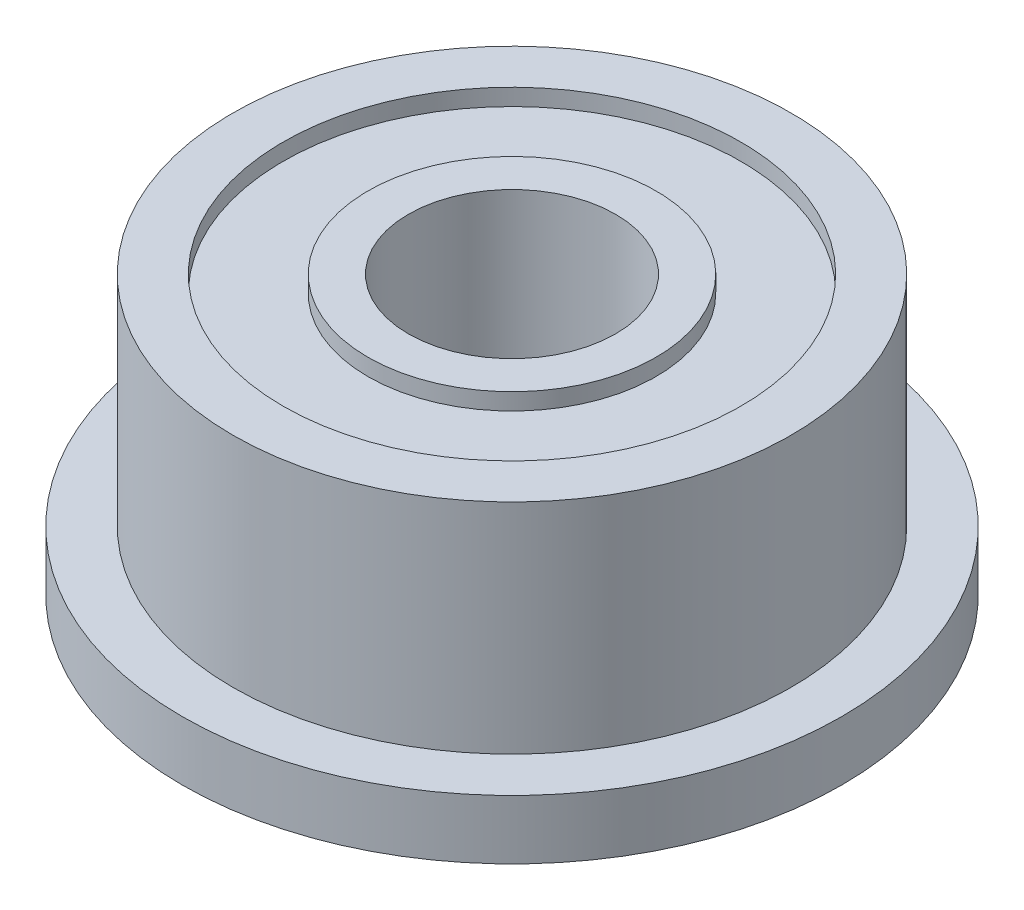
ISO-10303-21;
HEADER;
FILE_DESCRIPTION(('STEP AP214'),'2;1');
FILE_NAME('part.step','',(''),(''),'','','');
FILE_SCHEMA(('AUTOMOTIVE_DESIGN { 1 0 10303 214 1 1 1 1 }'));
ENDSEC;
DATA;
#1=APPLICATION_CONTEXT('core data for automotive mechanical design processes');
#2=APPLICATION_PROTOCOL_DEFINITION('international standard','automotive_design',2000,#1);
#3=PRODUCT_CONTEXT('',#1,'mechanical');
#4=PRODUCT('Part','Part','',(#3));
#5=PRODUCT_RELATED_PRODUCT_CATEGORY('part','',(#4));
#6=PRODUCT_DEFINITION_FORMATION('','',#4);
#7=PRODUCT_DEFINITION_CONTEXT('part definition',#1,'design');
#8=PRODUCT_DEFINITION('design','',#6,#7);
#9=PRODUCT_DEFINITION_SHAPE('','',#8);
#10=(LENGTH_UNIT() NAMED_UNIT(*) SI_UNIT(.MILLI.,.METRE.));
#11=(NAMED_UNIT(*) PLANE_ANGLE_UNIT() SI_UNIT($,.RADIAN.));
#12=(NAMED_UNIT(*) SI_UNIT($,.STERADIAN.) SOLID_ANGLE_UNIT());
#13=UNCERTAINTY_MEASURE_WITH_UNIT(LENGTH_MEASURE(1.E-05),#10,'distance_accuracy_value','');
#14=(GEOMETRIC_REPRESENTATION_CONTEXT(3) GLOBAL_UNCERTAINTY_ASSIGNED_CONTEXT((#13)) GLOBAL_UNIT_ASSIGNED_CONTEXT((#10,
#11,#12)) REPRESENTATION_CONTEXT('',''));
#15=CARTESIAN_POINT('',(0.,0.,0.));
#16=DIRECTION('',(0.,0.,1.));
#17=DIRECTION('',(1.,0.,0.));
#18=AXIS2_PLACEMENT_3D('',#15,#16,#17);
#19=CARTESIAN_POINT('',(0.,0.,0.));
#20=DIRECTION('',(0.,1.,0.));
#21=DIRECTION('',(0.,0.,1.));
#22=AXIS2_PLACEMENT_3D('',#19,#20,#21);
#23=PLANE('',#22);
#24=CARTESIAN_POINT('',(0.,0.,0.));
#25=DIRECTION('',(0.,1.,0.));
#26=DIRECTION('',(0.,0.,1.));
#27=AXIS2_PLACEMENT_3D('',#24,#25,#26);
#28=CIRCLE('',#27,1.485);
#29=CARTESIAN_POINT('',(0.,0.,1.485));
#30=VERTEX_POINT('',#29);
#31=EDGE_CURVE('E56',#30,#30,#28,.T.);
#32=ORIENTED_EDGE('',*,*,#31,.T.);
#33=EDGE_LOOP('',(#32));
#34=FACE_BOUND('',#33,.T.);
#35=CARTESIAN_POINT('',(0.,0.,0.));
#36=DIRECTION('',(0.,1.,0.));
#37=DIRECTION('',(0.,0.,1.));
#38=AXIS2_PLACEMENT_3D('',#35,#36,#37);
#39=CIRCLE('',#38,2.065);
#40=CARTESIAN_POINT('',(0.,0.,2.065));
#41=VERTEX_POINT('',#40);
#42=EDGE_CURVE('E16',#41,#41,#39,.T.);
#43=ORIENTED_EDGE('',*,*,#42,.F.);
#44=EDGE_LOOP('',(#43));
#45=FACE_BOUND('',#44,.T.);
#46=ADVANCED_FACE('F13',(#34,#45),#23,.F.);
#47=CARTESIAN_POINT('',(0.,-0.199,0.));
#48=DIRECTION('',(0.,1.,0.));
#49=DIRECTION('',(0.,0.,1.));
#50=AXIS2_PLACEMENT_3D('',#47,#48,#49);
#51=CYLINDRICAL_SURFACE('',#50,2.065);
#52=ORIENTED_EDGE('',*,*,#42,.T.);
#53=EDGE_LOOP('',(#52));
#54=FACE_BOUND('',#53,.T.);
#55=CARTESIAN_POINT('',(0.,0.24,0.));
#56=DIRECTION('',(0.,1.,0.));
#57=DIRECTION('',(0.,0.,1.));
#58=AXIS2_PLACEMENT_3D('',#55,#56,#57);
#59=CIRCLE('',#58,2.065);
#60=CARTESIAN_POINT('',(0.,0.24,2.065));
#61=VERTEX_POINT('',#60);
#62=EDGE_CURVE('E54',#61,#61,#59,.F.);
#63=ORIENTED_EDGE('',*,*,#62,.T.);
#64=EDGE_LOOP('',(#63));
#65=FACE_BOUND('',#64,.T.);
#66=ADVANCED_FACE('F63',(#54,#65),#51,.T.);
#67=CARTESIAN_POINT('',(0.,-0.199,0.));
#68=DIRECTION('',(0.,1.,0.));
#69=DIRECTION('',(0.,0.,1.));
#70=AXIS2_PLACEMENT_3D('',#67,#68,#69);
#71=CYLINDRICAL_SURFACE('',#70,1.485);
#72=CARTESIAN_POINT('',(0.,3.98,0.));
#73=DIRECTION('',(0.,1.,0.));
#74=DIRECTION('',(0.,0.,1.));
#75=AXIS2_PLACEMENT_3D('',#72,#73,#74);
#76=CIRCLE('',#75,1.485);
#77=CARTESIAN_POINT('',(0.,3.98,1.485));
#78=VERTEX_POINT('',#77);
#79=EDGE_CURVE('E51',#78,#78,#76,.F.);
#80=ORIENTED_EDGE('',*,*,#79,.F.);
#81=EDGE_LOOP('',(#80));
#82=FACE_BOUND('',#81,.T.);
#83=ORIENTED_EDGE('',*,*,#31,.F.);
#84=EDGE_LOOP('',(#83));
#85=FACE_BOUND('',#84,.T.);
#86=ADVANCED_FACE('F71',(#82,#85),#71,.F.);
#87=CARTESIAN_POINT('',(0.,0.24,0.));
#88=DIRECTION('',(0.,1.,0.));
#89=DIRECTION('',(0.,0.,1.));
#90=AXIS2_PLACEMENT_3D('',#87,#88,#89);
#91=PLANE('',#90);
#92=ORIENTED_EDGE('',*,*,#62,.F.);
#93=EDGE_LOOP('',(#92));
#94=FACE_BOUND('',#93,.T.);
#95=CARTESIAN_POINT('',(0.,0.24,0.));
#96=DIRECTION('',(0.,1.,0.));
#97=DIRECTION('',(0.,0.,1.));
#98=AXIS2_PLACEMENT_3D('',#95,#96,#97);
#99=CIRCLE('',#98,3.28);
#100=CARTESIAN_POINT('',(0.,0.24,3.28));
#101=VERTEX_POINT('',#100);
#102=EDGE_CURVE('E48',#101,#101,#99,.F.);
#103=ORIENTED_EDGE('',*,*,#102,.T.);
#104=EDGE_LOOP('',(#103));
#105=FACE_BOUND('',#104,.T.);
#106=ADVANCED_FACE('F114',(#94,#105),#91,.F.);
#107=CARTESIAN_POINT('',(0.,3.98,0.));
#108=DIRECTION('',(0.,1.,0.));
#109=DIRECTION('',(0.,0.,1.));
#110=AXIS2_PLACEMENT_3D('',#107,#108,#109);
#111=PLANE('',#110);
#112=ORIENTED_EDGE('',*,*,#79,.T.);
#113=EDGE_LOOP('',(#112));
#114=FACE_BOUND('',#113,.T.);
#115=CARTESIAN_POINT('',(0.,3.98,0.));
#116=DIRECTION('',(0.,1.,0.));
#117=DIRECTION('',(0.,0.,1.));
#118=AXIS2_PLACEMENT_3D('',#115,#116,#117);
#119=CIRCLE('',#118,2.065);
#120=CARTESIAN_POINT('',(0.,3.98,2.065));
#121=VERTEX_POINT('',#120);
#122=EDGE_CURVE('E45',#121,#121,#119,.F.);
#123=ORIENTED_EDGE('',*,*,#122,.F.);
#124=EDGE_LOOP('',(#123));
#125=FACE_BOUND('',#124,.T.);
#126=ADVANCED_FACE('F110',(#114,#125),#111,.T.);
#127=CARTESIAN_POINT('',(0.,-0.199,0.));
#128=DIRECTION('',(0.,1.,0.));
#129=DIRECTION('',(0.,0.,1.));
#130=AXIS2_PLACEMENT_3D('',#127,#128,#129);
#131=CYLINDRICAL_SURFACE('',#130,3.28);
#132=ORIENTED_EDGE('',*,*,#102,.F.);
#133=EDGE_LOOP('',(#132));
#134=FACE_BOUND('',#133,.T.);
#135=CARTESIAN_POINT('',(0.,0.,0.));
#136=DIRECTION('',(0.,1.,0.));
#137=DIRECTION('',(0.,0.,1.));
#138=AXIS2_PLACEMENT_3D('',#135,#136,#137);
#139=CIRCLE('',#138,3.28);
#140=CARTESIAN_POINT('',(0.,0.,3.28));
#141=VERTEX_POINT('',#140);
#142=EDGE_CURVE('E42',#141,#141,#139,.F.);
#143=ORIENTED_EDGE('',*,*,#142,.T.);
#144=EDGE_LOOP('',(#143));
#145=FACE_BOUND('',#144,.T.);
#146=ADVANCED_FACE('F106',(#134,#145),#131,.F.);
#147=CARTESIAN_POINT('',(0.,-0.199,0.));
#148=DIRECTION('',(0.,1.,0.));
#149=DIRECTION('',(0.,0.,1.));
#150=AXIS2_PLACEMENT_3D('',#147,#148,#149);
#151=CYLINDRICAL_SURFACE('',#150,2.065);
#152=CARTESIAN_POINT('',(0.,3.74,0.));
#153=DIRECTION('',(0.,1.,0.));
#154=DIRECTION('',(0.,0.,1.));
#155=AXIS2_PLACEMENT_3D('',#152,#153,#154);
#156=CIRCLE('',#155,2.065);
#157=CARTESIAN_POINT('',(0.,3.74,2.065));
#158=VERTEX_POINT('',#157);
#159=EDGE_CURVE('E39',#158,#158,#156,.F.);
#160=ORIENTED_EDGE('',*,*,#159,.F.);
#161=EDGE_LOOP('',(#160));
#162=FACE_BOUND('',#161,.T.);
#163=ORIENTED_EDGE('',*,*,#122,.T.);
#164=EDGE_LOOP('',(#163));
#165=FACE_BOUND('',#164,.T.);
#166=ADVANCED_FACE('F102',(#162,#165),#151,.T.);
#167=CARTESIAN_POINT('',(0.,0.,0.));
#168=DIRECTION('',(0.,1.,0.));
#169=DIRECTION('',(0.,0.,1.));
#170=AXIS2_PLACEMENT_3D('',#167,#168,#169);
#171=PLANE('',#170);
#172=ORIENTED_EDGE('',*,*,#142,.F.);
#173=EDGE_LOOP('',(#172));
#174=FACE_BOUND('',#173,.T.);
#175=CARTESIAN_POINT('',(0.,0.,0.));
#176=DIRECTION('',(0.,1.,0.));
#177=DIRECTION('',(0.,0.,1.));
#178=AXIS2_PLACEMENT_3D('',#175,#176,#177);
#179=CIRCLE('',#178,4.725);
#180=CARTESIAN_POINT('',(0.,0.,4.725));
#181=VERTEX_POINT('',#180);
#182=EDGE_CURVE('E36',#181,#181,#179,.T.);
#183=ORIENTED_EDGE('',*,*,#182,.F.);
#184=EDGE_LOOP('',(#183));
#185=FACE_BOUND('',#184,.T.);
#186=ADVANCED_FACE('F98',(#174,#185),#171,.F.);
#187=CARTESIAN_POINT('',(0.,3.74,0.));
#188=DIRECTION('',(0.,1.,0.));
#189=DIRECTION('',(0.,0.,1.));
#190=AXIS2_PLACEMENT_3D('',#187,#188,#189);
#191=PLANE('',#190);
#192=ORIENTED_EDGE('',*,*,#159,.T.);
#193=EDGE_LOOP('',(#192));
#194=FACE_BOUND('',#193,.T.);
#195=CARTESIAN_POINT('',(0.,3.74,0.));
#196=DIRECTION('',(0.,1.,0.));
#197=DIRECTION('',(0.,0.,1.));
#198=AXIS2_PLACEMENT_3D('',#195,#196,#197);
#199=CIRCLE('',#198,3.28);
#200=CARTESIAN_POINT('',(0.,3.74,3.28));
#201=VERTEX_POINT('',#200);
#202=EDGE_CURVE('E33',#201,#201,#199,.T.);
#203=ORIENTED_EDGE('',*,*,#202,.T.);
#204=EDGE_LOOP('',(#203));
#205=FACE_BOUND('',#204,.T.);
#206=ADVANCED_FACE('F94',(#194,#205),#191,.T.);
#207=CARTESIAN_POINT('',(0.,-0.199,0.));
#208=DIRECTION('',(0.,1.,0.));
#209=DIRECTION('',(0.,0.,1.));
#210=AXIS2_PLACEMENT_3D('',#207,#208,#209);
#211=CYLINDRICAL_SURFACE('',#210,4.725);
#212=CARTESIAN_POINT('',(0.,0.85,0.));
#213=DIRECTION('',(0.,1.,0.));
#214=DIRECTION('',(0.,0.,1.));
#215=AXIS2_PLACEMENT_3D('',#212,#213,#214);
#216=CIRCLE('',#215,4.725);
#217=CARTESIAN_POINT('',(0.,0.85,4.725));
#218=VERTEX_POINT('',#217);
#219=EDGE_CURVE('E30',#218,#218,#216,.T.);
#220=ORIENTED_EDGE('',*,*,#219,.F.);
#221=EDGE_LOOP('',(#220));
#222=FACE_BOUND('',#221,.T.);
#223=ORIENTED_EDGE('',*,*,#182,.T.);
#224=EDGE_LOOP('',(#223));
#225=FACE_BOUND('',#224,.T.);
#226=ADVANCED_FACE('F90',(#222,#225),#211,.T.);
#227=CARTESIAN_POINT('',(0.,-0.199,0.));
#228=DIRECTION('',(0.,1.,0.));
#229=DIRECTION('',(0.,0.,1.));
#230=AXIS2_PLACEMENT_3D('',#227,#228,#229);
#231=CYLINDRICAL_SURFACE('',#230,3.28);
#232=CARTESIAN_POINT('',(0.,3.98,0.));
#233=DIRECTION('',(0.,1.,0.));
#234=DIRECTION('',(0.,0.,1.));
#235=AXIS2_PLACEMENT_3D('',#232,#233,#234);
#236=CIRCLE('',#235,3.28);
#237=CARTESIAN_POINT('',(0.,3.98,3.28));
#238=VERTEX_POINT('',#237);
#239=EDGE_CURVE('E25',#238,#238,#236,.F.);
#240=ORIENTED_EDGE('',*,*,#239,.F.);
#241=EDGE_LOOP('',(#240));
#242=FACE_BOUND('',#241,.T.);
#243=ORIENTED_EDGE('',*,*,#202,.F.);
#244=EDGE_LOOP('',(#243));
#245=FACE_BOUND('',#244,.T.);
#246=ADVANCED_FACE('F86',(#242,#245),#231,.F.);
#247=CARTESIAN_POINT('',(0.,0.85,0.));
#248=DIRECTION('',(0.,1.,0.));
#249=DIRECTION('',(0.,0.,1.));
#250=AXIS2_PLACEMENT_3D('',#247,#248,#249);
#251=PLANE('',#250);
#252=CARTESIAN_POINT('',(0.,0.85,0.));
#253=DIRECTION('',(0.,1.,0.));
#254=DIRECTION('',(0.,0.,1.));
#255=AXIS2_PLACEMENT_3D('',#252,#253,#254);
#256=CIRCLE('',#255,4.);
#257=CARTESIAN_POINT('',(0.,0.85,4.));
#258=VERTEX_POINT('',#257);
#259=EDGE_CURVE('E20',#258,#258,#256,.T.);
#260=ORIENTED_EDGE('',*,*,#259,.F.);
#261=EDGE_LOOP('',(#260));
#262=FACE_BOUND('',#261,.T.);
#263=ORIENTED_EDGE('',*,*,#219,.T.);
#264=EDGE_LOOP('',(#263));
#265=FACE_BOUND('',#264,.T.);
#266=ADVANCED_FACE('F79',(#262,#265),#251,.T.);
#267=CARTESIAN_POINT('',(0.,3.98,0.));
#268=DIRECTION('',(0.,1.,0.));
#269=DIRECTION('',(0.,0.,1.));
#270=AXIS2_PLACEMENT_3D('',#267,#268,#269);
#271=PLANE('',#270);
#272=ORIENTED_EDGE('',*,*,#239,.T.);
#273=EDGE_LOOP('',(#272));
#274=FACE_BOUND('',#273,.T.);
#275=CARTESIAN_POINT('',(0.,3.98,0.));
#276=DIRECTION('',(0.,1.,0.));
#277=DIRECTION('',(0.,0.,1.));
#278=AXIS2_PLACEMENT_3D('',#275,#276,#277);
#279=CIRCLE('',#278,4.);
#280=CARTESIAN_POINT('',(0.,3.98,4.));
#281=VERTEX_POINT('',#280);
#282=EDGE_CURVE('E9',#281,#281,#279,.F.);
#283=ORIENTED_EDGE('',*,*,#282,.F.);
#284=EDGE_LOOP('',(#283));
#285=FACE_BOUND('',#284,.T.);
#286=ADVANCED_FACE('F74',(#274,#285),#271,.T.);
#287=CARTESIAN_POINT('',(0.,-0.199,0.));
#288=DIRECTION('',(0.,1.,0.));
#289=DIRECTION('',(0.,0.,1.));
#290=AXIS2_PLACEMENT_3D('',#287,#288,#289);
#291=CYLINDRICAL_SURFACE('',#290,4.);
#292=ORIENTED_EDGE('',*,*,#282,.T.);
#293=EDGE_LOOP('',(#292));
#294=FACE_BOUND('',#293,.T.);
#295=ORIENTED_EDGE('',*,*,#259,.T.);
#296=EDGE_LOOP('',(#295));
#297=FACE_BOUND('',#296,.T.);
#298=ADVANCED_FACE('F72',(#294,#297),#291,.T.);
#299=CLOSED_SHELL('',(#46,#66,#86,#106,#126,#146,#166,#186,#206,#226,#246,#266,#286,#298));
#300=MANIFOLD_SOLID_BREP('B1',#299);
#301=ADVANCED_BREP_SHAPE_REPRESENTATION('',(#18,#300),#14);
#302=SHAPE_DEFINITION_REPRESENTATION(#9,#301);
ENDSEC;
END-ISO-10303-21;
